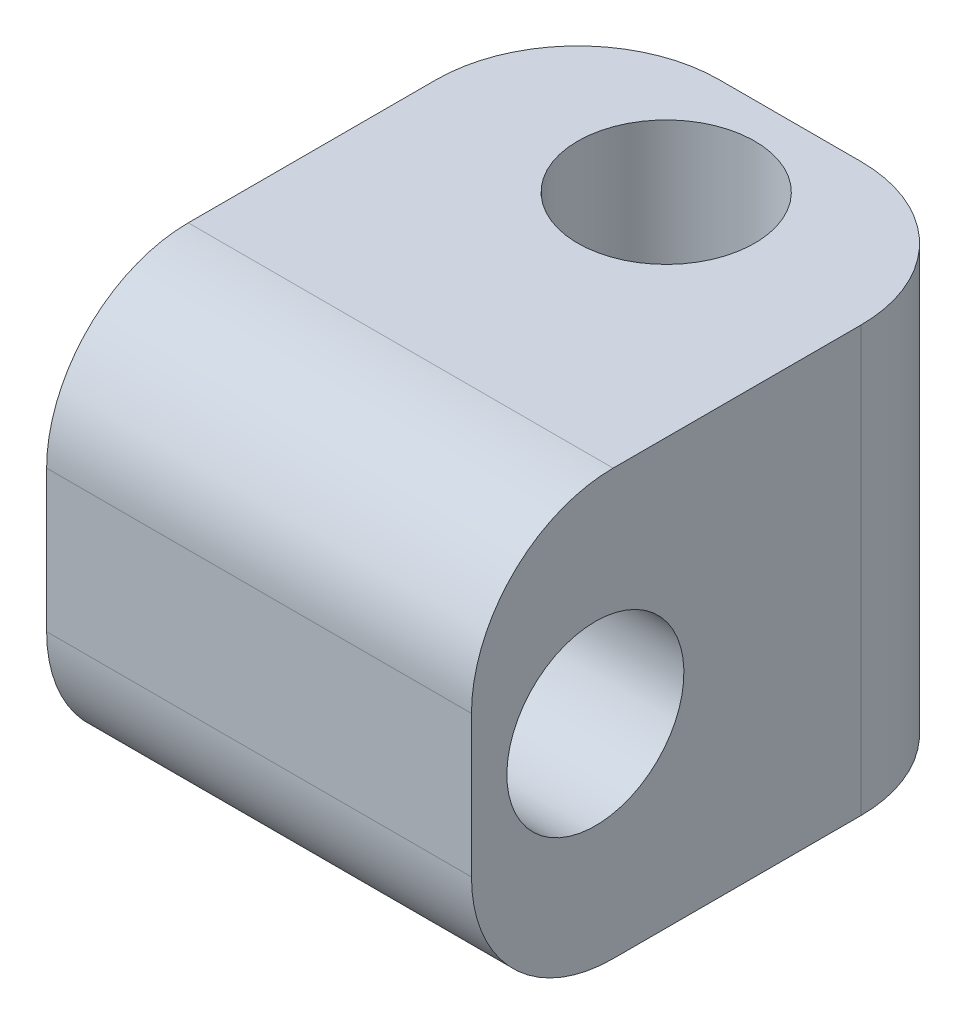
ISO-10303-21;
HEADER;
FILE_DESCRIPTION(('STEP AP214'),'2;1');
FILE_NAME('part.step','',(''),(''),'','','');
FILE_SCHEMA(('AUTOMOTIVE_DESIGN { 1 0 10303 214 1 1 1 1 }'));
ENDSEC;
DATA;
#1=APPLICATION_CONTEXT('core data for automotive mechanical design processes');
#2=APPLICATION_PROTOCOL_DEFINITION('international standard','automotive_design',2000,#1);
#3=PRODUCT_CONTEXT('',#1,'mechanical');
#4=PRODUCT('Part','Part','',(#3));
#5=PRODUCT_RELATED_PRODUCT_CATEGORY('part','',(#4));
#6=PRODUCT_DEFINITION_FORMATION('','',#4);
#7=PRODUCT_DEFINITION_CONTEXT('part definition',#1,'design');
#8=PRODUCT_DEFINITION('design','',#6,#7);
#9=PRODUCT_DEFINITION_SHAPE('','',#8);
#10=(LENGTH_UNIT() NAMED_UNIT(*) SI_UNIT(.MILLI.,.METRE.));
#11=(NAMED_UNIT(*) PLANE_ANGLE_UNIT() SI_UNIT($,.RADIAN.));
#12=(NAMED_UNIT(*) SI_UNIT($,.STERADIAN.) SOLID_ANGLE_UNIT());
#13=UNCERTAINTY_MEASURE_WITH_UNIT(LENGTH_MEASURE(1.E-05),#10,'distance_accuracy_value','');
#14=(GEOMETRIC_REPRESENTATION_CONTEXT(3) GLOBAL_UNCERTAINTY_ASSIGNED_CONTEXT((#13)) GLOBAL_UNIT_ASSIGNED_CONTEXT((#10,
#11,#12)) REPRESENTATION_CONTEXT('',''));
#15=CARTESIAN_POINT('',(0.,0.,0.));
#16=DIRECTION('',(0.,0.,1.));
#17=DIRECTION('',(1.,0.,0.));
#18=AXIS2_PLACEMENT_3D('',#15,#16,#17);
#19=CARTESIAN_POINT('',(-6.,6.,7.5));
#20=DIRECTION('',(1.,0.,0.));
#21=DIRECTION('',(0.,0.,-1.));
#22=AXIS2_PLACEMENT_3D('',#19,#20,#21);
#23=PLANE('',#22);
#24=CARTESIAN_POINT('',(-6.,0.,4.));
#25=DIRECTION('',(1.,0.,0.));
#26=DIRECTION('',(0.,1.,0.));
#27=AXIS2_PLACEMENT_3D('',#24,#25,#26);
#28=CIRCLE('',#27,2.5);
#29=CARTESIAN_POINT('',(-6.,2.5,4.));
#30=VERTEX_POINT('',#29);
#31=EDGE_CURVE('E289',#30,#30,#28,.T.);
#32=ORIENTED_EDGE('',*,*,#31,.T.);
#33=EDGE_LOOP('',(#32));
#34=FACE_BOUND('',#33,.T.);
#35=DIRECTION('',(0.,0.,-1.));
#36=VECTOR('',#35,1.);
#37=CARTESIAN_POINT('',(-6.,6.,7.5));
#38=LINE('',#37,#36);
#39=CARTESIAN_POINT('',(-6.,6.,3.5));
#40=VERTEX_POINT('',#39);
#41=CARTESIAN_POINT('',(-6.,6.,-3.5));
#42=VERTEX_POINT('',#41);
#43=EDGE_CURVE('E149',#40,#42,#38,.T.);
#44=ORIENTED_EDGE('',*,*,#43,.T.);
#45=DIRECTION('',(0.,-1.,0.));
#46=VECTOR('',#45,1.);
#47=CARTESIAN_POINT('',(-6.,6.,-3.5));
#48=LINE('',#47,#46);
#49=CARTESIAN_POINT('',(-6.,-6.,-3.5));
#50=VERTEX_POINT('',#49);
#51=EDGE_CURVE('E106',#42,#50,#48,.T.);
#52=ORIENTED_EDGE('',*,*,#51,.T.);
#53=DIRECTION('',(0.,0.,-1.));
#54=VECTOR('',#53,1.);
#55=CARTESIAN_POINT('',(-6.,-6.,7.5));
#56=LINE('',#55,#54);
#57=CARTESIAN_POINT('',(-6.,-6.,3.5));
#58=VERTEX_POINT('',#57);
#59=EDGE_CURVE('E101',#58,#50,#56,.T.);
#60=ORIENTED_EDGE('',*,*,#59,.F.);
#61=CARTESIAN_POINT('',(-6.,-2.,3.5));
#62=DIRECTION('',(1.,0.,0.));
#63=DIRECTION('',(0.,0.,-1.));
#64=AXIS2_PLACEMENT_3D('',#61,#62,#63);
#65=CIRCLE('',#64,4.);
#66=CARTESIAN_POINT('',(-6.,-2.,7.5));
#67=VERTEX_POINT('',#66);
#68=EDGE_CURVE('E112',#58,#67,#65,.F.);
#69=ORIENTED_EDGE('',*,*,#68,.T.);
#70=DIRECTION('',(0.,-1.,0.));
#71=VECTOR('',#70,1.);
#72=CARTESIAN_POINT('',(-6.,6.,7.5));
#73=LINE('',#72,#71);
#74=CARTESIAN_POINT('',(-6.,2.,7.5));
#75=VERTEX_POINT('',#74);
#76=EDGE_CURVE('E143',#75,#67,#73,.T.);
#77=ORIENTED_EDGE('',*,*,#76,.F.);
#78=CARTESIAN_POINT('',(-6.,2.,3.5));
#79=DIRECTION('',(1.,0.,0.));
#80=DIRECTION('',(0.,0.,-1.));
#81=AXIS2_PLACEMENT_3D('',#78,#79,#80);
#82=CIRCLE('',#81,4.);
#83=EDGE_CURVE('E115',#75,#40,#82,.F.);
#84=ORIENTED_EDGE('',*,*,#83,.T.);
#85=EDGE_LOOP('',(#44,#52,#60,#69,#77,#84));
#86=FACE_BOUND('',#85,.T.);
#87=ADVANCED_FACE('F31',(#34,#86),#23,.F.);
#88=CARTESIAN_POINT('',(-6.,-6.,7.5));
#89=DIRECTION('',(0.,1.,0.));
#90=DIRECTION('',(-1.,0.,0.));
#91=AXIS2_PLACEMENT_3D('',#88,#89,#90);
#92=PLANE('',#91);
#93=CARTESIAN_POINT('',(0.,-6.,-4.));
#94=DIRECTION('',(0.,1.,0.));
#95=DIRECTION('',(-1.,0.,0.));
#96=AXIS2_PLACEMENT_3D('',#93,#94,#95);
#97=CIRCLE('',#96,2.5);
#98=CARTESIAN_POINT('',(-2.5,-6.,-4.));
#99=VERTEX_POINT('',#98);
#100=EDGE_CURVE('E159',#99,#99,#97,.T.);
#101=ORIENTED_EDGE('',*,*,#100,.T.);
#102=EDGE_LOOP('',(#101));
#103=FACE_BOUND('',#102,.T.);
#104=ORIENTED_EDGE('',*,*,#59,.T.);
#105=CARTESIAN_POINT('',(-2.,-6.,-3.5));
#106=DIRECTION('',(0.,1.,0.));
#107=DIRECTION('',(-1.,0.,0.));
#108=AXIS2_PLACEMENT_3D('',#105,#106,#107);
#109=CIRCLE('',#108,4.);
#110=CARTESIAN_POINT('',(-2.,-6.,-7.5));
#111=VERTEX_POINT('',#110);
#112=EDGE_CURVE('E123',#50,#111,#109,.F.);
#113=ORIENTED_EDGE('',*,*,#112,.T.);
#114=DIRECTION('',(1.,0.,0.));
#115=VECTOR('',#114,1.);
#116=CARTESIAN_POINT('',(-6.,-6.,-7.5));
#117=LINE('',#116,#115);
#118=CARTESIAN_POINT('',(2.,-6.,-7.5));
#119=VERTEX_POINT('',#118);
#120=EDGE_CURVE('E152',#111,#119,#117,.T.);
#121=ORIENTED_EDGE('',*,*,#120,.T.);
#122=CARTESIAN_POINT('',(2.,-6.,-3.5));
#123=DIRECTION('',(0.,1.,0.));
#124=DIRECTION('',(-1.,0.,0.));
#125=AXIS2_PLACEMENT_3D('',#122,#123,#124);
#126=CIRCLE('',#125,4.);
#127=CARTESIAN_POINT('',(6.,-6.,-3.5));
#128=VERTEX_POINT('',#127);
#129=EDGE_CURVE('E105',#119,#128,#126,.F.);
#130=ORIENTED_EDGE('',*,*,#129,.T.);
#131=DIRECTION('',(0.,0.,-1.));
#132=VECTOR('',#131,1.);
#133=CARTESIAN_POINT('',(6.,-6.,7.5));
#134=LINE('',#133,#132);
#135=CARTESIAN_POINT('',(6.,-6.,3.5));
#136=VERTEX_POINT('',#135);
#137=EDGE_CURVE('E103',#136,#128,#134,.T.);
#138=ORIENTED_EDGE('',*,*,#137,.F.);
#139=DIRECTION('',(1.,0.,0.));
#140=VECTOR('',#139,1.);
#141=CARTESIAN_POINT('',(-6.,-6.,3.5));
#142=LINE('',#141,#140);
#143=EDGE_CURVE('E98',#136,#58,#142,.F.);
#144=ORIENTED_EDGE('',*,*,#143,.T.);
#145=EDGE_LOOP('',(#104,#113,#121,#130,#138,#144));
#146=FACE_BOUND('',#145,.T.);
#147=ADVANCED_FACE('F100',(#103,#146),#92,.F.);
#148=CARTESIAN_POINT('',(6.,6.,7.5));
#149=DIRECTION('',(-1.,0.,0.));
#150=DIRECTION('',(0.,0.,1.));
#151=AXIS2_PLACEMENT_3D('',#148,#149,#150);
#152=PLANE('',#151);
#153=CARTESIAN_POINT('',(6.,0.,4.));
#154=DIRECTION('',(1.,0.,0.));
#155=DIRECTION('',(0.,1.,0.));
#156=AXIS2_PLACEMENT_3D('',#153,#154,#155);
#157=CIRCLE('',#156,2.5);
#158=CARTESIAN_POINT('',(6.,2.5,4.));
#159=VERTEX_POINT('',#158);
#160=EDGE_CURVE('E287',#159,#159,#157,.T.);
#161=ORIENTED_EDGE('',*,*,#160,.F.);
#162=EDGE_LOOP('',(#161));
#163=FACE_BOUND('',#162,.T.);
#164=ORIENTED_EDGE('',*,*,#137,.T.);
#165=DIRECTION('',(0.,1.,0.));
#166=VECTOR('',#165,1.);
#167=CARTESIAN_POINT('',(6.,6.,-3.5));
#168=LINE('',#167,#166);
#169=CARTESIAN_POINT('',(6.,6.,-3.5));
#170=VERTEX_POINT('',#169);
#171=EDGE_CURVE('E137',#128,#170,#168,.T.);
#172=ORIENTED_EDGE('',*,*,#171,.T.);
#173=DIRECTION('',(0.,0.,-1.));
#174=VECTOR('',#173,1.);
#175=CARTESIAN_POINT('',(6.,6.,7.5));
#176=LINE('',#175,#174);
#177=CARTESIAN_POINT('',(6.,6.,3.5));
#178=VERTEX_POINT('',#177);
#179=EDGE_CURVE('E162',#178,#170,#176,.T.);
#180=ORIENTED_EDGE('',*,*,#179,.F.);
#181=CARTESIAN_POINT('',(6.,2.,3.5));
#182=DIRECTION('',(-1.,0.,0.));
#183=DIRECTION('',(0.,0.,1.));
#184=AXIS2_PLACEMENT_3D('',#181,#182,#183);
#185=CIRCLE('',#184,4.);
#186=CARTESIAN_POINT('',(6.,2.,7.5));
#187=VERTEX_POINT('',#186);
#188=EDGE_CURVE('E46',#178,#187,#185,.F.);
#189=ORIENTED_EDGE('',*,*,#188,.T.);
#190=DIRECTION('',(0.,1.,0.));
#191=VECTOR('',#190,1.);
#192=CARTESIAN_POINT('',(6.,6.,7.5));
#193=LINE('',#192,#191);
#194=CARTESIAN_POINT('',(6.,-2.,7.5));
#195=VERTEX_POINT('',#194);
#196=EDGE_CURVE('E144',#195,#187,#193,.T.);
#197=ORIENTED_EDGE('',*,*,#196,.F.);
#198=CARTESIAN_POINT('',(6.,-2.,3.5));
#199=DIRECTION('',(-1.,0.,0.));
#200=DIRECTION('',(0.,0.,1.));
#201=AXIS2_PLACEMENT_3D('',#198,#199,#200);
#202=CIRCLE('',#201,4.);
#203=EDGE_CURVE('E54',#195,#136,#202,.F.);
#204=ORIENTED_EDGE('',*,*,#203,.T.);
#205=EDGE_LOOP('',(#164,#172,#180,#189,#197,#204));
#206=FACE_BOUND('',#205,.T.);
#207=ADVANCED_FACE('F166',(#163,#206),#152,.F.);
#208=CARTESIAN_POINT('',(-6.,6.,7.5));
#209=DIRECTION('',(0.,-1.,0.));
#210=DIRECTION('',(1.,0.,0.));
#211=AXIS2_PLACEMENT_3D('',#208,#209,#210);
#212=PLANE('',#211);
#213=CARTESIAN_POINT('',(0.,6.,-4.));
#214=DIRECTION('',(0.,1.,0.));
#215=DIRECTION('',(-1.,0.,0.));
#216=AXIS2_PLACEMENT_3D('',#213,#214,#215);
#217=CIRCLE('',#216,2.5);
#218=CARTESIAN_POINT('',(-2.5,6.,-4.));
#219=VERTEX_POINT('',#218);
#220=EDGE_CURVE('E155',#219,#219,#217,.T.);
#221=ORIENTED_EDGE('',*,*,#220,.F.);
#222=EDGE_LOOP('',(#221));
#223=FACE_BOUND('',#222,.T.);
#224=DIRECTION('',(-1.,0.,0.));
#225=VECTOR('',#224,1.);
#226=CARTESIAN_POINT('',(-6.,6.,-7.5));
#227=LINE('',#226,#225);
#228=CARTESIAN_POINT('',(2.,6.,-7.5));
#229=VERTEX_POINT('',#228);
#230=CARTESIAN_POINT('',(-2.,6.,-7.5));
#231=VERTEX_POINT('',#230);
#232=EDGE_CURVE('E147',#229,#231,#227,.T.);
#233=ORIENTED_EDGE('',*,*,#232,.T.);
#234=CARTESIAN_POINT('',(-2.,6.,-3.5));
#235=DIRECTION('',(0.,-1.,0.));
#236=DIRECTION('',(1.,0.,0.));
#237=AXIS2_PLACEMENT_3D('',#234,#235,#236);
#238=CIRCLE('',#237,4.);
#239=EDGE_CURVE('E133',#231,#42,#238,.F.);
#240=ORIENTED_EDGE('',*,*,#239,.T.);
#241=ORIENTED_EDGE('',*,*,#43,.F.);
#242=DIRECTION('',(-1.,0.,0.));
#243=VECTOR('',#242,1.);
#244=CARTESIAN_POINT('',(6.,6.,3.5));
#245=LINE('',#244,#243);
#246=EDGE_CURVE('E129',#40,#178,#245,.F.);
#247=ORIENTED_EDGE('',*,*,#246,.T.);
#248=ORIENTED_EDGE('',*,*,#179,.T.);
#249=CARTESIAN_POINT('',(2.,6.,-3.5));
#250=DIRECTION('',(0.,-1.,0.));
#251=DIRECTION('',(1.,0.,0.));
#252=AXIS2_PLACEMENT_3D('',#249,#250,#251);
#253=CIRCLE('',#252,4.);
#254=EDGE_CURVE('E131',#170,#229,#253,.F.);
#255=ORIENTED_EDGE('',*,*,#254,.T.);
#256=EDGE_LOOP('',(#233,#240,#241,#247,#248,#255));
#257=FACE_BOUND('',#256,.T.);
#258=ADVANCED_FACE('F173',(#223,#257),#212,.F.);
#259=CARTESIAN_POINT('',(-6.,-6.,7.5));
#260=DIRECTION('',(0.,0.,1.));
#261=DIRECTION('',(1.,0.,0.));
#262=AXIS2_PLACEMENT_3D('',#259,#260,#261);
#263=PLANE('',#262);
#264=ORIENTED_EDGE('',*,*,#76,.T.);
#265=DIRECTION('',(1.,0.,0.));
#266=VECTOR('',#265,1.);
#267=CARTESIAN_POINT('',(6.,-2.,7.5));
#268=LINE('',#267,#266);
#269=EDGE_CURVE('E11',#67,#195,#268,.T.);
#270=ORIENTED_EDGE('',*,*,#269,.T.);
#271=ORIENTED_EDGE('',*,*,#196,.T.);
#272=DIRECTION('',(-1.,0.,0.));
#273=VECTOR('',#272,1.);
#274=CARTESIAN_POINT('',(-6.,2.,7.5));
#275=LINE('',#274,#273);
#276=EDGE_CURVE('E39',#187,#75,#275,.T.);
#277=ORIENTED_EDGE('',*,*,#276,.T.);
#278=EDGE_LOOP('',(#264,#270,#271,#277));
#279=FACE_BOUND('',#278,.T.);
#280=ADVANCED_FACE('F142',(#279),#263,.T.);
#281=CARTESIAN_POINT('',(-6.,-6.,-7.5));
#282=DIRECTION('',(0.,0.,1.));
#283=DIRECTION('',(1.,0.,0.));
#284=AXIS2_PLACEMENT_3D('',#281,#282,#283);
#285=PLANE('',#284);
#286=ORIENTED_EDGE('',*,*,#120,.F.);
#287=DIRECTION('',(0.,-1.,0.));
#288=VECTOR('',#287,1.);
#289=CARTESIAN_POINT('',(-2.,-6.,-7.5));
#290=LINE('',#289,#288);
#291=EDGE_CURVE('E127',#111,#231,#290,.F.);
#292=ORIENTED_EDGE('',*,*,#291,.T.);
#293=ORIENTED_EDGE('',*,*,#232,.F.);
#294=DIRECTION('',(0.,1.,0.));
#295=VECTOR('',#294,1.);
#296=CARTESIAN_POINT('',(2.,-6.,-7.5));
#297=LINE('',#296,#295);
#298=EDGE_CURVE('E125',#229,#119,#297,.F.);
#299=ORIENTED_EDGE('',*,*,#298,.T.);
#300=EDGE_LOOP('',(#286,#292,#293,#299));
#301=FACE_BOUND('',#300,.T.);
#302=ADVANCED_FACE('F177',(#301),#285,.F.);
#303=CARTESIAN_POINT('',(0.,-6.,-4.));
#304=DIRECTION('',(0.,1.,0.));
#305=DIRECTION('',(-1.,0.,0.));
#306=AXIS2_PLACEMENT_3D('',#303,#304,#305);
#307=CYLINDRICAL_SURFACE('',#306,2.5);
#308=ORIENTED_EDGE('',*,*,#100,.F.);
#309=EDGE_LOOP('',(#308));
#310=FACE_BOUND('',#309,.T.);
#311=ORIENTED_EDGE('',*,*,#220,.T.);
#312=EDGE_LOOP('',(#311));
#313=FACE_BOUND('',#312,.T.);
#314=ADVANCED_FACE('F230',(#310,#313),#307,.F.);
#315=CARTESIAN_POINT('',(-6.,0.,4.));
#316=DIRECTION('',(1.,0.,0.));
#317=DIRECTION('',(0.,1.,0.));
#318=AXIS2_PLACEMENT_3D('',#315,#316,#317);
#319=CYLINDRICAL_SURFACE('',#318,2.5);
#320=ORIENTED_EDGE('',*,*,#31,.F.);
#321=EDGE_LOOP('',(#320));
#322=FACE_BOUND('',#321,.T.);
#323=ORIENTED_EDGE('',*,*,#160,.T.);
#324=EDGE_LOOP('',(#323));
#325=FACE_BOUND('',#324,.T.);
#326=ADVANCED_FACE('F199',(#322,#325),#319,.F.);
#327=CARTESIAN_POINT('',(-2.,6.,-3.5));
#328=DIRECTION('',(0.,-1.,0.));
#329=DIRECTION('',(0.,0.,-1.));
#330=AXIS2_PLACEMENT_3D('',#327,#328,#329);
#331=CYLINDRICAL_SURFACE('',#330,4.);
#332=ORIENTED_EDGE('',*,*,#239,.F.);
#333=ORIENTED_EDGE('',*,*,#291,.F.);
#334=ORIENTED_EDGE('',*,*,#112,.F.);
#335=ORIENTED_EDGE('',*,*,#51,.F.);
#336=EDGE_LOOP('',(#332,#333,#334,#335));
#337=FACE_BOUND('',#336,.T.);
#338=ADVANCED_FACE('F180',(#337),#331,.T.);
#339=CARTESIAN_POINT('',(2.,6.,-3.5));
#340=DIRECTION('',(0.,1.,0.));
#341=DIRECTION('',(0.,0.,1.));
#342=AXIS2_PLACEMENT_3D('',#339,#340,#341);
#343=CYLINDRICAL_SURFACE('',#342,4.);
#344=ORIENTED_EDGE('',*,*,#129,.F.);
#345=ORIENTED_EDGE('',*,*,#298,.F.);
#346=ORIENTED_EDGE('',*,*,#254,.F.);
#347=ORIENTED_EDGE('',*,*,#171,.F.);
#348=EDGE_LOOP('',(#344,#345,#346,#347));
#349=FACE_BOUND('',#348,.T.);
#350=ADVANCED_FACE('F169',(#349),#343,.T.);
#351=CARTESIAN_POINT('',(-6.,-2.,3.5));
#352=DIRECTION('',(-1.,0.,0.));
#353=DIRECTION('',(0.,-1.,0.));
#354=AXIS2_PLACEMENT_3D('',#351,#352,#353);
#355=CYLINDRICAL_SURFACE('',#354,4.);
#356=ORIENTED_EDGE('',*,*,#68,.F.);
#357=ORIENTED_EDGE('',*,*,#143,.F.);
#358=ORIENTED_EDGE('',*,*,#203,.F.);
#359=ORIENTED_EDGE('',*,*,#269,.F.);
#360=EDGE_LOOP('',(#356,#357,#358,#359));
#361=FACE_BOUND('',#360,.T.);
#362=ADVANCED_FACE('F117',(#361),#355,.T.);
#363=CARTESIAN_POINT('',(-6.,2.,3.5));
#364=DIRECTION('',(1.,0.,0.));
#365=DIRECTION('',(0.,1.,0.));
#366=AXIS2_PLACEMENT_3D('',#363,#364,#365);
#367=CYLINDRICAL_SURFACE('',#366,4.);
#368=ORIENTED_EDGE('',*,*,#188,.F.);
#369=ORIENTED_EDGE('',*,*,#246,.F.);
#370=ORIENTED_EDGE('',*,*,#83,.F.);
#371=ORIENTED_EDGE('',*,*,#276,.F.);
#372=EDGE_LOOP('',(#368,#369,#370,#371));
#373=FACE_BOUND('',#372,.T.);
#374=ADVANCED_FACE('F33',(#373),#367,.T.);
#375=CLOSED_SHELL('',(#87,#147,#207,#258,#280,#302,#314,#326,#338,#350,#362,#374));
#376=MANIFOLD_SOLID_BREP('B2',#375);
#377=ADVANCED_BREP_SHAPE_REPRESENTATION('',(#18,#376),#14);
#378=SHAPE_DEFINITION_REPRESENTATION(#9,#377);
ENDSEC;
END-ISO-10303-21;
